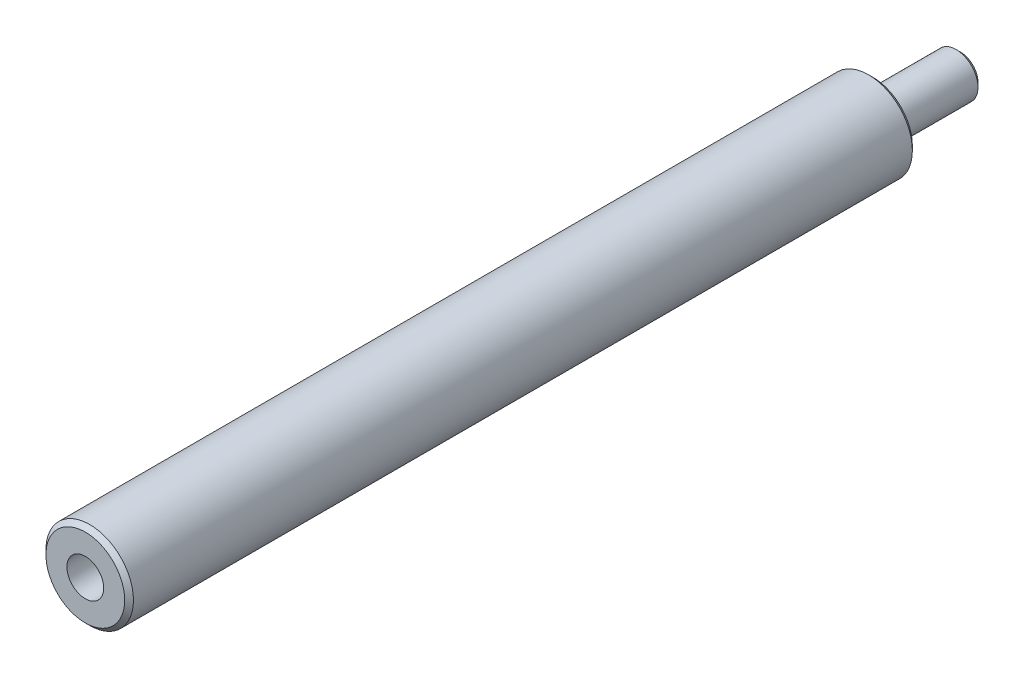
ISO-10303-21;
HEADER;
FILE_DESCRIPTION(('STEP AP214'),'2;1');
FILE_NAME('part.step','',(''),(''),'','','');
FILE_SCHEMA(('AUTOMOTIVE_DESIGN { 1 0 10303 214 1 1 1 1 }'));
ENDSEC;
DATA;
#1=APPLICATION_CONTEXT('core data for automotive mechanical design processes');
#2=APPLICATION_PROTOCOL_DEFINITION('international standard','automotive_design',2000,#1);
#3=PRODUCT_CONTEXT('',#1,'mechanical');
#4=PRODUCT('Part','Part','',(#3));
#5=PRODUCT_RELATED_PRODUCT_CATEGORY('part','',(#4));
#6=PRODUCT_DEFINITION_FORMATION('','',#4);
#7=PRODUCT_DEFINITION_CONTEXT('part definition',#1,'design');
#8=PRODUCT_DEFINITION('design','',#6,#7);
#9=PRODUCT_DEFINITION_SHAPE('','',#8);
#10=(LENGTH_UNIT() NAMED_UNIT(*) SI_UNIT(.MILLI.,.METRE.));
#11=(NAMED_UNIT(*) PLANE_ANGLE_UNIT() SI_UNIT($,.RADIAN.));
#12=(NAMED_UNIT(*) SI_UNIT($,.STERADIAN.) SOLID_ANGLE_UNIT());
#13=UNCERTAINTY_MEASURE_WITH_UNIT(LENGTH_MEASURE(1.E-05),#10,'distance_accuracy_value','');
#14=(GEOMETRIC_REPRESENTATION_CONTEXT(3) GLOBAL_UNCERTAINTY_ASSIGNED_CONTEXT((#13)) GLOBAL_UNIT_ASSIGNED_CONTEXT((#10,
#11,#12)) REPRESENTATION_CONTEXT('',''));
#15=CARTESIAN_POINT('',(0.,0.,0.));
#16=DIRECTION('',(0.,0.,1.));
#17=DIRECTION('',(1.,0.,0.));
#18=AXIS2_PLACEMENT_3D('',#15,#16,#17);
#19=CARTESIAN_POINT('',(0.,0.,90.));
#20=DIRECTION('',(0.,0.,-1.));
#21=DIRECTION('',(-1.,0.,0.));
#22=AXIS2_PLACEMENT_3D('',#19,#20,#21);
#23=CYLINDRICAL_SURFACE('',#22,5.);
#24=CARTESIAN_POINT('',(0.,0.,0.500000000000084));
#25=DIRECTION('',(0.,0.,1.));
#26=DIRECTION('',(1.,0.,0.));
#27=AXIS2_PLACEMENT_3D('',#24,#25,#26);
#28=CIRCLE('',#27,5.);
#29=CARTESIAN_POINT('',(5.,0.,0.500000000000084));
#30=VERTEX_POINT('',#29);
#31=EDGE_CURVE('E74',#30,#30,#28,.T.);
#32=ORIENTED_EDGE('',*,*,#31,.T.);
#33=EDGE_LOOP('',(#32));
#34=FACE_BOUND('',#33,.T.);
#35=CARTESIAN_POINT('',(0.,0.,89.5000000000001));
#36=DIRECTION('',(0.,0.,1.));
#37=DIRECTION('',(1.,0.,0.));
#38=AXIS2_PLACEMENT_3D('',#35,#36,#37);
#39=CIRCLE('',#38,5.);
#40=CARTESIAN_POINT('',(5.,0.,89.5000000000001));
#41=VERTEX_POINT('',#40);
#42=EDGE_CURVE('E71',#41,#41,#39,.F.);
#43=ORIENTED_EDGE('',*,*,#42,.T.);
#44=EDGE_LOOP('',(#43));
#45=FACE_BOUND('',#44,.T.);
#46=ADVANCED_FACE('F37',(#34,#45),#23,.T.);
#47=CARTESIAN_POINT('',(0.,0.,90.));
#48=DIRECTION('',(0.,0.,1.));
#49=DIRECTION('',(1.,0.,0.));
#50=AXIS2_PLACEMENT_3D('',#47,#48,#49);
#51=PLANE('',#50);
#52=CARTESIAN_POINT('',(0.,0.,90.));
#53=DIRECTION('',(0.,0.,1.));
#54=DIRECTION('',(1.,0.,0.));
#55=AXIS2_PLACEMENT_3D('',#52,#53,#54);
#56=CIRCLE('',#55,4.50000000000007);
#57=CARTESIAN_POINT('',(4.50000000000007,0.,90.));
#58=VERTEX_POINT('',#57);
#59=EDGE_CURVE('E11',#58,#58,#56,.T.);
#60=ORIENTED_EDGE('',*,*,#59,.T.);
#61=EDGE_LOOP('',(#60));
#62=FACE_BOUND('',#61,.T.);
#63=CARTESIAN_POINT('',(0.,0.,90.));
#64=DIRECTION('',(0.,0.,1.));
#65=DIRECTION('',(1.,0.,0.));
#66=AXIS2_PLACEMENT_3D('',#63,#64,#65);
#67=CIRCLE('',#66,2.1);
#68=CARTESIAN_POINT('',(2.1,0.,90.));
#69=VERTEX_POINT('',#68);
#70=EDGE_CURVE('E58',#69,#69,#67,.T.);
#71=ORIENTED_EDGE('',*,*,#70,.F.);
#72=EDGE_LOOP('',(#71));
#73=FACE_BOUND('',#72,.T.);
#74=ADVANCED_FACE('F90',(#62,#73),#51,.T.);
#75=CARTESIAN_POINT('',(0.,0.,0.));
#76=DIRECTION('',(0.,0.,1.));
#77=DIRECTION('',(1.,0.,0.));
#78=AXIS2_PLACEMENT_3D('',#75,#76,#77);
#79=PLANE('',#78);
#80=CARTESIAN_POINT('',(0.,0.,0.));
#81=DIRECTION('',(0.,0.,1.));
#82=DIRECTION('',(1.,0.,0.));
#83=AXIS2_PLACEMENT_3D('',#80,#81,#82);
#84=CIRCLE('',#83,4.49999999999991);
#85=CARTESIAN_POINT('',(4.49999999999991,0.,0.));
#86=VERTEX_POINT('',#85);
#87=EDGE_CURVE('E44',#86,#86,#84,.F.);
#88=ORIENTED_EDGE('',*,*,#87,.T.);
#89=EDGE_LOOP('',(#88));
#90=FACE_BOUND('',#89,.T.);
#91=CARTESIAN_POINT('',(0.,0.,0.));
#92=DIRECTION('',(0.,0.,-1.));
#93=DIRECTION('',(-1.,0.,0.));
#94=AXIS2_PLACEMENT_3D('',#91,#92,#93);
#95=CIRCLE('',#94,2.5);
#96=CARTESIAN_POINT('',(-2.5,0.,0.));
#97=VERTEX_POINT('',#96);
#98=EDGE_CURVE('E57',#97,#97,#95,.T.);
#99=ORIENTED_EDGE('',*,*,#98,.F.);
#100=EDGE_LOOP('',(#99));
#101=FACE_BOUND('',#100,.T.);
#102=ADVANCED_FACE('F79',(#90,#101),#79,.F.);
#103=CARTESIAN_POINT('',(0.,0.,-10.));
#104=DIRECTION('',(0.,0.,1.));
#105=DIRECTION('',(1.,0.,0.));
#106=AXIS2_PLACEMENT_3D('',#103,#104,#105);
#107=CYLINDRICAL_SURFACE('',#106,2.5);
#108=CARTESIAN_POINT('',(0.,0.,-9.49999999999999));
#109=DIRECTION('',(0.,0.,-1.));
#110=DIRECTION('',(-1.,0.,0.));
#111=AXIS2_PLACEMENT_3D('',#108,#109,#110);
#112=CIRCLE('',#111,2.5);
#113=CARTESIAN_POINT('',(-2.5,0.,-9.49999999999999));
#114=VERTEX_POINT('',#113);
#115=EDGE_CURVE('E68',#114,#114,#112,.F.);
#116=ORIENTED_EDGE('',*,*,#115,.T.);
#117=EDGE_LOOP('',(#116));
#118=FACE_BOUND('',#117,.T.);
#119=ORIENTED_EDGE('',*,*,#98,.T.);
#120=EDGE_LOOP('',(#119));
#121=FACE_BOUND('',#120,.T.);
#122=ADVANCED_FACE('F113',(#118,#121),#107,.T.);
#123=CARTESIAN_POINT('',(0.,0.,-10.));
#124=DIRECTION('',(0.,0.,-1.));
#125=DIRECTION('',(-1.,0.,0.));
#126=AXIS2_PLACEMENT_3D('',#123,#124,#125);
#127=PLANE('',#126);
#128=CARTESIAN_POINT('',(0.,0.,-10.));
#129=DIRECTION('',(0.,0.,-1.));
#130=DIRECTION('',(-1.,0.,0.));
#131=AXIS2_PLACEMENT_3D('',#128,#129,#130);
#132=CIRCLE('',#131,2.);
#133=CARTESIAN_POINT('',(-2.,0.,-10.));
#134=VERTEX_POINT('',#133);
#135=EDGE_CURVE('E61',#134,#134,#132,.T.);
#136=ORIENTED_EDGE('',*,*,#135,.T.);
#137=EDGE_LOOP('',(#136));
#138=FACE_BOUND('',#137,.T.);
#139=ADVANCED_FACE('F51',(#138),#127,.T.);
#140=CARTESIAN_POINT('',(0.,0.,80.));
#141=DIRECTION('',(0.,0.,1.));
#142=DIRECTION('',(1.,0.,0.));
#143=AXIS2_PLACEMENT_3D('',#140,#141,#142);
#144=CONICAL_SURFACE('',#143,2.1,1.02974425867665);
#145=CARTESIAN_POINT('',(0.,0.,78.7381927000421));
#146=VERTEX_POINT('',#145);
#147=VERTEX_LOOP('',#146);
#148=FACE_BOUND('',#147,.T.);
#149=CARTESIAN_POINT('',(0.,0.,80.));
#150=DIRECTION('',(0.,0.,1.));
#151=DIRECTION('',(1.,0.,0.));
#152=AXIS2_PLACEMENT_3D('',#149,#150,#151);
#153=CIRCLE('',#152,2.1);
#154=CARTESIAN_POINT('',(2.1,0.,80.));
#155=VERTEX_POINT('',#154);
#156=EDGE_CURVE('E55',#155,#155,#153,.T.);
#157=ORIENTED_EDGE('',*,*,#156,.T.);
#158=EDGE_LOOP('',(#157));
#159=FACE_BOUND('',#158,.T.);
#160=ADVANCED_FACE('F47',(#148,#159),#144,.F.);
#161=CARTESIAN_POINT('',(0.,0.,90.));
#162=DIRECTION('',(0.,0.,1.));
#163=DIRECTION('',(1.,0.,0.));
#164=AXIS2_PLACEMENT_3D('',#161,#162,#163);
#165=CYLINDRICAL_SURFACE('',#164,2.1);
#166=ORIENTED_EDGE('',*,*,#156,.F.);
#167=EDGE_LOOP('',(#166));
#168=FACE_BOUND('',#167,.T.);
#169=ORIENTED_EDGE('',*,*,#70,.T.);
#170=EDGE_LOOP('',(#169));
#171=FACE_BOUND('',#170,.T.);
#172=ADVANCED_FACE('F50',(#168,#171),#165,.F.);
#173=CARTESIAN_POINT('',(0.,0.,-10.));
#174=DIRECTION('',(0.,0.,1.));
#175=DIRECTION('',(1.,0.,0.));
#176=AXIS2_PLACEMENT_3D('',#173,#174,#175);
#177=CONICAL_SURFACE('',#176,2.,0.78539816339744);
#178=ORIENTED_EDGE('',*,*,#115,.F.);
#179=EDGE_LOOP('',(#178));
#180=FACE_BOUND('',#179,.T.);
#181=ORIENTED_EDGE('',*,*,#135,.F.);
#182=EDGE_LOOP('',(#181));
#183=FACE_BOUND('',#182,.T.);
#184=ADVANCED_FACE('F85',(#180,#183),#177,.T.);
#185=CARTESIAN_POINT('',(0.,0.,0.500000000000084));
#186=DIRECTION('',(0.,0.,1.));
#187=DIRECTION('',(1.,0.,0.));
#188=AXIS2_PLACEMENT_3D('',#185,#186,#187);
#189=CONICAL_SURFACE('',#188,5.,0.785398163397459);
#190=ORIENTED_EDGE('',*,*,#87,.F.);
#191=EDGE_LOOP('',(#190));
#192=FACE_BOUND('',#191,.T.);
#193=ORIENTED_EDGE('',*,*,#31,.F.);
#194=EDGE_LOOP('',(#193));
#195=FACE_BOUND('',#194,.T.);
#196=ADVANCED_FACE('F82',(#192,#195),#189,.T.);
#197=CARTESIAN_POINT('',(0.,0.,90.));
#198=DIRECTION('',(0.,0.,-1.));
#199=DIRECTION('',(-1.,0.,0.));
#200=AXIS2_PLACEMENT_3D('',#197,#198,#199);
#201=CONICAL_SURFACE('',#200,4.50000000000007,0.785398163397445);
#202=ORIENTED_EDGE('',*,*,#42,.F.);
#203=EDGE_LOOP('',(#202));
#204=FACE_BOUND('',#203,.T.);
#205=ORIENTED_EDGE('',*,*,#59,.F.);
#206=EDGE_LOOP('',(#205));
#207=FACE_BOUND('',#206,.T.);
#208=ADVANCED_FACE('F39',(#204,#207),#201,.T.);
#209=CLOSED_SHELL('',(#46,#74,#102,#122,#139,#160,#172,#184,#196,#208));
#210=MANIFOLD_SOLID_BREP('B2',#209);
#211=ADVANCED_BREP_SHAPE_REPRESENTATION('',(#18,#210),#14);
#212=SHAPE_DEFINITION_REPRESENTATION(#9,#211);
ENDSEC;
END-ISO-10303-21;
